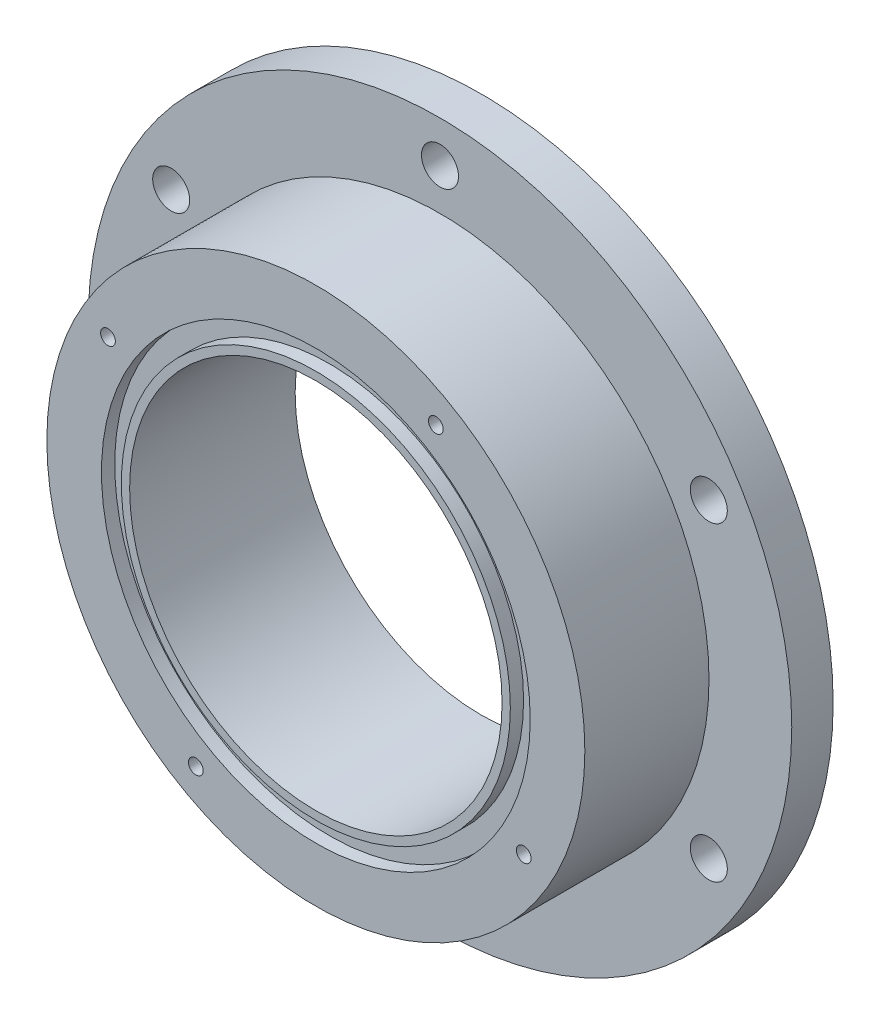
ISO-10303-21;
HEADER;
FILE_DESCRIPTION(('STEP AP214'),'2;1');
FILE_NAME('part.step','',(''),(''),'','','');
FILE_SCHEMA(('AUTOMOTIVE_DESIGN { 1 0 10303 214 1 1 1 1 }'));
ENDSEC;
DATA;
#1=APPLICATION_CONTEXT('core data for automotive mechanical design processes');
#2=APPLICATION_PROTOCOL_DEFINITION('international standard','automotive_design',2000,#1);
#3=PRODUCT_CONTEXT('',#1,'mechanical');
#4=PRODUCT('Part','Part','',(#3));
#5=PRODUCT_RELATED_PRODUCT_CATEGORY('part','',(#4));
#6=PRODUCT_DEFINITION_FORMATION('','',#4);
#7=PRODUCT_DEFINITION_CONTEXT('part definition',#1,'design');
#8=PRODUCT_DEFINITION('design','',#6,#7);
#9=PRODUCT_DEFINITION_SHAPE('','',#8);
#10=(LENGTH_UNIT() NAMED_UNIT(*) SI_UNIT(.MILLI.,.METRE.));
#11=(NAMED_UNIT(*) PLANE_ANGLE_UNIT() SI_UNIT($,.RADIAN.));
#12=(NAMED_UNIT(*) SI_UNIT($,.STERADIAN.) SOLID_ANGLE_UNIT());
#13=UNCERTAINTY_MEASURE_WITH_UNIT(LENGTH_MEASURE(1.E-05),#10,'distance_accuracy_value','');
#14=(GEOMETRIC_REPRESENTATION_CONTEXT(3) GLOBAL_UNCERTAINTY_ASSIGNED_CONTEXT((#13)) GLOBAL_UNIT_ASSIGNED_CONTEXT((#10,
#11,#12)) REPRESENTATION_CONTEXT('',''));
#15=CARTESIAN_POINT('',(0.,0.,0.));
#16=DIRECTION('',(0.,0.,1.));
#17=DIRECTION('',(1.,0.,0.));
#18=AXIS2_PLACEMENT_3D('',#15,#16,#17);
#19=CARTESIAN_POINT('',(0.,0.,25.4));
#20=DIRECTION('',(0.,0.,1.));
#21=DIRECTION('',(1.,0.,0.));
#22=AXIS2_PLACEMENT_3D('',#19,#20,#21);
#23=PLANE('',#22);
#24=CARTESIAN_POINT('',(0.,0.,25.4));
#25=DIRECTION('',(0.,0.,1.));
#26=DIRECTION('',(1.,0.,0.));
#27=AXIS2_PLACEMENT_3D('',#24,#25,#26);
#28=CIRCLE('',#27,28.575);
#29=CARTESIAN_POINT('',(28.575,0.,25.4));
#30=VERTEX_POINT('',#29);
#31=EDGE_CURVE('E106',#30,#30,#28,.T.);
#32=ORIENTED_EDGE('',*,*,#31,.F.);
#33=EDGE_LOOP('',(#32));
#34=FACE_BOUND('',#33,.T.);
#35=CARTESIAN_POINT('',(0.,0.,25.4));
#36=DIRECTION('',(0.,0.,1.));
#37=DIRECTION('',(1.,0.,0.));
#38=AXIS2_PLACEMENT_3D('',#35,#36,#37);
#39=CIRCLE('',#38,29.845);
#40=CARTESIAN_POINT('',(29.845,0.,25.4));
#41=VERTEX_POINT('',#40);
#42=EDGE_CURVE('E96',#41,#41,#39,.T.);
#43=ORIENTED_EDGE('',*,*,#42,.T.);
#44=EDGE_LOOP('',(#43));
#45=FACE_BOUND('',#44,.T.);
#46=ADVANCED_FACE('F38',(#34,#45),#23,.T.);
#47=CARTESIAN_POINT('',(0.,0.,25.4));
#48=DIRECTION('',(0.,0.,-1.));
#49=DIRECTION('',(-1.,0.,0.));
#50=AXIS2_PLACEMENT_3D('',#47,#48,#49);
#51=CYLINDRICAL_SURFACE('',#50,53.975);
#52=CARTESIAN_POINT('',(0.,0.,0.));
#53=DIRECTION('',(0.,0.,1.));
#54=DIRECTION('',(1.,0.,0.));
#55=AXIS2_PLACEMENT_3D('',#52,#53,#54);
#56=CIRCLE('',#55,53.975);
#57=CARTESIAN_POINT('',(53.975,0.,0.));
#58=VERTEX_POINT('',#57);
#59=EDGE_CURVE('E13',#58,#58,#56,.T.);
#60=ORIENTED_EDGE('',*,*,#59,.T.);
#61=EDGE_LOOP('',(#60));
#62=FACE_BOUND('',#61,.T.);
#63=CARTESIAN_POINT('',(0.,0.,6.35));
#64=DIRECTION('',(0.,0.,1.));
#65=DIRECTION('',(1.,0.,0.));
#66=AXIS2_PLACEMENT_3D('',#63,#64,#65);
#67=CIRCLE('',#66,53.975);
#68=CARTESIAN_POINT('',(53.975,0.,6.35));
#69=VERTEX_POINT('',#68);
#70=EDGE_CURVE('E47',#69,#69,#67,.T.);
#71=ORIENTED_EDGE('',*,*,#70,.F.);
#72=EDGE_LOOP('',(#71));
#73=FACE_BOUND('',#72,.T.);
#74=ADVANCED_FACE('F40',(#62,#73),#51,.T.);
#75=CARTESIAN_POINT('',(0.,0.,0.));
#76=DIRECTION('',(0.,0.,1.));
#77=DIRECTION('',(1.,0.,0.));
#78=AXIS2_PLACEMENT_3D('',#75,#76,#77);
#79=PLANE('',#78);
#80=CARTESIAN_POINT('',(41.2444598552336,23.8125000000005,0.));
#81=DIRECTION('',(0.,0.,-1.));
#82=DIRECTION('',(-0.50000000000001,0.866025403784433,0.));
#83=AXIS2_PLACEMENT_3D('',#80,#81,#82);
#84=CIRCLE('',#83,2.8406204239451);
#85=CARTESIAN_POINT('',(39.824149643261,26.2725494496458,0.));
#86=VERTEX_POINT('',#85);
#87=EDGE_CURVE('E148',#86,#86,#84,.T.);
#88=ORIENTED_EDGE('',*,*,#87,.F.);
#89=EDGE_LOOP('',(#88));
#90=FACE_BOUND('',#89,.T.);
#91=CARTESIAN_POINT('',(41.2444598552341,-23.8124999999996,0.));
#92=DIRECTION('',(0.,0.,-1.));
#93=DIRECTION('',(0.499999999999992,0.866025403784443,0.));
#94=AXIS2_PLACEMENT_3D('',#91,#92,#93);
#95=CIRCLE('',#94,2.8406204239451);
#96=CARTESIAN_POINT('',(42.6647700672066,-21.3524505503542,0.));
#97=VERTEX_POINT('',#96);
#98=EDGE_CURVE('E151',#97,#97,#95,.T.);
#99=ORIENTED_EDGE('',*,*,#98,.F.);
#100=EDGE_LOOP('',(#99));
#101=FACE_BOUND('',#100,.T.);
#102=CARTESIAN_POINT('',(0.,-47.625,0.));
#103=DIRECTION('',(0.,0.,-1.));
#104=DIRECTION('',(1.,0.,0.));
#105=AXIS2_PLACEMENT_3D('',#102,#103,#104);
#106=CIRCLE('',#105,2.8406204239451);
#107=CARTESIAN_POINT('',(2.8406204239451,-47.625,0.));
#108=VERTEX_POINT('',#107);
#109=EDGE_CURVE('E154',#108,#108,#106,.T.);
#110=ORIENTED_EDGE('',*,*,#109,.F.);
#111=EDGE_LOOP('',(#110));
#112=FACE_BOUND('',#111,.T.);
#113=CARTESIAN_POINT('',(-41.2444598552338,-23.8125000000002,0.));
#114=DIRECTION('',(0.,0.,-1.));
#115=DIRECTION('',(0.500000000000004,-0.866025403784436,0.));
#116=AXIS2_PLACEMENT_3D('',#113,#114,#115);
#117=CIRCLE('',#116,2.8406204239451);
#118=CARTESIAN_POINT('',(-39.8241496432612,-26.2725494496456,0.));
#119=VERTEX_POINT('',#118);
#120=EDGE_CURVE('E147',#119,#119,#117,.T.);
#121=ORIENTED_EDGE('',*,*,#120,.F.);
#122=EDGE_LOOP('',(#121));
#123=FACE_BOUND('',#122,.T.);
#124=CARTESIAN_POINT('',(-41.2444598552339,23.8124999999999,0.));
#125=DIRECTION('',(0.,0.,-1.));
#126=DIRECTION('',(-0.499999999999998,-0.86602540378444,0.));
#127=AXIS2_PLACEMENT_3D('',#124,#125,#126);
#128=CIRCLE('',#127,2.8406204239451);
#129=CARTESIAN_POINT('',(-42.6647700672065,21.3524505503545,0.));
#130=VERTEX_POINT('',#129);
#131=EDGE_CURVE('E129',#130,#130,#128,.T.);
#132=ORIENTED_EDGE('',*,*,#131,.F.);
#133=EDGE_LOOP('',(#132));
#134=FACE_BOUND('',#133,.T.);
#135=CARTESIAN_POINT('',(0.,47.625,0.));
#136=DIRECTION('',(0.,0.,-1.));
#137=DIRECTION('',(-1.,0.,0.));
#138=AXIS2_PLACEMENT_3D('',#135,#136,#137);
#139=CIRCLE('',#138,2.8406204239451);
#140=CARTESIAN_POINT('',(-2.8406204239451,47.625,0.));
#141=VERTEX_POINT('',#140);
#142=EDGE_CURVE('E124',#141,#141,#139,.T.);
#143=ORIENTED_EDGE('',*,*,#142,.F.);
#144=EDGE_LOOP('',(#143));
#145=FACE_BOUND('',#144,.T.);
#146=CARTESIAN_POINT('',(0.,0.,0.));
#147=DIRECTION('',(0.,0.,1.));
#148=DIRECTION('',(1.,0.,0.));
#149=AXIS2_PLACEMENT_3D('',#146,#147,#148);
#150=CIRCLE('',#149,28.575);
#151=CARTESIAN_POINT('',(28.575,0.,0.));
#152=VERTEX_POINT('',#151);
#153=EDGE_CURVE('E109',#152,#152,#150,.T.);
#154=ORIENTED_EDGE('',*,*,#153,.T.);
#155=EDGE_LOOP('',(#154));
#156=FACE_BOUND('',#155,.T.);
#157=ORIENTED_EDGE('',*,*,#59,.F.);
#158=EDGE_LOOP('',(#157));
#159=FACE_BOUND('',#158,.T.);
#160=ADVANCED_FACE('F162',(#90,#101,#112,#123,#134,#145,#156,#159),#79,.F.);
#161=CARTESIAN_POINT('',(0.,0.,6.35));
#162=DIRECTION('',(0.,0.,1.));
#163=DIRECTION('',(1.,0.,0.));
#164=AXIS2_PLACEMENT_3D('',#161,#162,#163);
#165=PLANE('',#164);
#166=CARTESIAN_POINT('',(41.2444598552336,23.8125000000005,6.35));
#167=DIRECTION('',(0.,0.,1.));
#168=DIRECTION('',(1.,0.,0.));
#169=AXIS2_PLACEMENT_3D('',#166,#167,#168);
#170=CIRCLE('',#169,2.8406204239451);
#171=CARTESIAN_POINT('',(44.0850802791787,23.8125000000005,6.35));
#172=VERTEX_POINT('',#171);
#173=EDGE_CURVE('E42',#172,#172,#170,.T.);
#174=ORIENTED_EDGE('',*,*,#173,.F.);
#175=EDGE_LOOP('',(#174));
#176=FACE_BOUND('',#175,.T.);
#177=CARTESIAN_POINT('',(41.2444598552341,-23.8124999999996,6.35));
#178=DIRECTION('',(0.,0.,1.));
#179=DIRECTION('',(1.,0.,0.));
#180=AXIS2_PLACEMENT_3D('',#177,#178,#179);
#181=CIRCLE('',#180,2.8406204239451);
#182=CARTESIAN_POINT('',(44.0850802791792,-23.8124999999996,6.35));
#183=VERTEX_POINT('',#182);
#184=EDGE_CURVE('E134',#183,#183,#181,.T.);
#185=ORIENTED_EDGE('',*,*,#184,.F.);
#186=EDGE_LOOP('',(#185));
#187=FACE_BOUND('',#186,.T.);
#188=CARTESIAN_POINT('',(0.,-47.625,6.35));
#189=DIRECTION('',(0.,0.,1.));
#190=DIRECTION('',(1.,0.,0.));
#191=AXIS2_PLACEMENT_3D('',#188,#189,#190);
#192=CIRCLE('',#191,2.8406204239451);
#193=CARTESIAN_POINT('',(2.8406204239451,-47.625,6.35));
#194=VERTEX_POINT('',#193);
#195=EDGE_CURVE('E132',#194,#194,#192,.T.);
#196=ORIENTED_EDGE('',*,*,#195,.F.);
#197=EDGE_LOOP('',(#196));
#198=FACE_BOUND('',#197,.T.);
#199=CARTESIAN_POINT('',(-41.2444598552338,-23.8125000000002,6.35));
#200=DIRECTION('',(0.,0.,1.));
#201=DIRECTION('',(1.,0.,0.));
#202=AXIS2_PLACEMENT_3D('',#199,#200,#201);
#203=CIRCLE('',#202,2.8406204239451);
#204=CARTESIAN_POINT('',(-38.4038394312887,-23.8125000000002,6.35));
#205=VERTEX_POINT('',#204);
#206=EDGE_CURVE('E128',#205,#205,#203,.T.);
#207=ORIENTED_EDGE('',*,*,#206,.F.);
#208=EDGE_LOOP('',(#207));
#209=FACE_BOUND('',#208,.T.);
#210=CARTESIAN_POINT('',(-41.2444598552339,23.8124999999999,6.35));
#211=DIRECTION('',(0.,0.,1.));
#212=DIRECTION('',(1.,0.,0.));
#213=AXIS2_PLACEMENT_3D('',#210,#211,#212);
#214=CIRCLE('',#213,2.8406204239451);
#215=CARTESIAN_POINT('',(-38.4038394312889,23.8124999999999,6.35));
#216=VERTEX_POINT('',#215);
#217=EDGE_CURVE('E125',#216,#216,#214,.T.);
#218=ORIENTED_EDGE('',*,*,#217,.F.);
#219=EDGE_LOOP('',(#218));
#220=FACE_BOUND('',#219,.T.);
#221=CARTESIAN_POINT('',(0.,47.625,6.35));
#222=DIRECTION('',(0.,0.,1.));
#223=DIRECTION('',(1.,0.,0.));
#224=AXIS2_PLACEMENT_3D('',#221,#222,#223);
#225=CIRCLE('',#224,2.8406204239451);
#226=CARTESIAN_POINT('',(2.8406204239451,47.625,6.35));
#227=VERTEX_POINT('',#226);
#228=EDGE_CURVE('E78',#227,#227,#225,.T.);
#229=ORIENTED_EDGE('',*,*,#228,.F.);
#230=EDGE_LOOP('',(#229));
#231=FACE_BOUND('',#230,.T.);
#232=CARTESIAN_POINT('',(0.,0.,6.34999999999999));
#233=DIRECTION('',(0.,0.,1.));
#234=DIRECTION('',(1.,0.,0.));
#235=AXIS2_PLACEMENT_3D('',#232,#233,#234);
#236=CIRCLE('',#235,41.275);
#237=CARTESIAN_POINT('',(41.275,0.,6.34999999999999));
#238=VERTEX_POINT('',#237);
#239=EDGE_CURVE('E117',#238,#238,#236,.F.);
#240=ORIENTED_EDGE('',*,*,#239,.T.);
#241=EDGE_LOOP('',(#240));
#242=FACE_BOUND('',#241,.T.);
#243=ORIENTED_EDGE('',*,*,#70,.T.);
#244=EDGE_LOOP('',(#243));
#245=FACE_BOUND('',#244,.T.);
#246=ADVANCED_FACE('F165',(#176,#187,#198,#209,#220,#231,#242,#245),#165,.T.);
#247=CARTESIAN_POINT('',(0.,0.,-154.190997598757));
#248=DIRECTION('',(0.,0.,1.));
#249=DIRECTION('',(1.,0.,0.));
#250=AXIS2_PLACEMENT_3D('',#247,#248,#249);
#251=CYLINDRICAL_SURFACE('',#250,41.275);
#252=ORIENTED_EDGE('',*,*,#239,.F.);
#253=EDGE_LOOP('',(#252));
#254=FACE_BOUND('',#253,.T.);
#255=CARTESIAN_POINT('',(0.,0.,25.4));
#256=DIRECTION('',(0.,0.,1.));
#257=DIRECTION('',(1.,0.,0.));
#258=AXIS2_PLACEMENT_3D('',#255,#256,#257);
#259=CIRCLE('',#258,41.275);
#260=CARTESIAN_POINT('',(41.275,0.,25.4));
#261=VERTEX_POINT('',#260);
#262=EDGE_CURVE('E112',#261,#261,#259,.T.);
#263=ORIENTED_EDGE('',*,*,#262,.F.);
#264=EDGE_LOOP('',(#263));
#265=FACE_BOUND('',#264,.T.);
#266=ADVANCED_FACE('F179',(#254,#265),#251,.T.);
#267=CARTESIAN_POINT('',(31.895715621381,-18.4149999999997,25.4));
#268=DIRECTION('',(0.,0.,1.));
#269=DIRECTION('',(1.,0.,0.));
#270=AXIS2_PLACEMENT_3D('',#267,#268,#269);
#271=CIRCLE('',#270,1.1303);
#272=CARTESIAN_POINT('',(33.026015621381,-18.4149999999997,25.4));
#273=VERTEX_POINT('',#272);
#274=EDGE_CURVE('E72',#273,#273,#271,.T.);
#275=ORIENTED_EDGE('',*,*,#274,.F.);
#276=EDGE_LOOP('',(#275));
#277=FACE_BOUND('',#276,.T.);
#278=CARTESIAN_POINT('',(-18.415,-31.8957156213808,25.4));
#279=DIRECTION('',(0.,0.,1.));
#280=DIRECTION('',(1.,0.,0.));
#281=AXIS2_PLACEMENT_3D('',#278,#279,#280);
#282=CIRCLE('',#281,1.1303);
#283=CARTESIAN_POINT('',(-17.2847,-31.8957156213808,25.4));
#284=VERTEX_POINT('',#283);
#285=EDGE_CURVE('E71',#284,#284,#282,.T.);
#286=ORIENTED_EDGE('',*,*,#285,.F.);
#287=EDGE_LOOP('',(#286));
#288=FACE_BOUND('',#287,.T.);
#289=CARTESIAN_POINT('',(-31.8957156213809,18.4149999999999,25.4));
#290=DIRECTION('',(0.,0.,1.));
#291=DIRECTION('',(1.,0.,0.));
#292=AXIS2_PLACEMENT_3D('',#289,#290,#291);
#293=CIRCLE('',#292,1.1303);
#294=CARTESIAN_POINT('',(-30.7654156213809,18.4149999999999,25.4));
#295=VERTEX_POINT('',#294);
#296=EDGE_CURVE('E84',#295,#295,#293,.T.);
#297=ORIENTED_EDGE('',*,*,#296,.F.);
#298=EDGE_LOOP('',(#297));
#299=FACE_BOUND('',#298,.T.);
#300=CARTESIAN_POINT('',(18.415,31.8957156213808,25.4));
#301=DIRECTION('',(0.,0.,1.));
#302=DIRECTION('',(1.,0.,0.));
#303=AXIS2_PLACEMENT_3D('',#300,#301,#302);
#304=CIRCLE('',#303,1.1303);
#305=CARTESIAN_POINT('',(19.5453,31.8957156213808,25.4));
#306=VERTEX_POINT('',#305);
#307=EDGE_CURVE('E90',#306,#306,#304,.T.);
#308=ORIENTED_EDGE('',*,*,#307,.F.);
#309=EDGE_LOOP('',(#308));
#310=FACE_BOUND('',#309,.T.);
#311=CARTESIAN_POINT('',(0.,0.,25.4));
#312=DIRECTION('',(0.,0.,1.));
#313=DIRECTION('',(1.,0.,0.));
#314=AXIS2_PLACEMENT_3D('',#311,#312,#313);
#315=CIRCLE('',#314,32.893);
#316=CARTESIAN_POINT('',(32.893,0.,25.4));
#317=VERTEX_POINT('',#316);
#318=EDGE_CURVE('E100',#317,#317,#315,.T.);
#319=ORIENTED_EDGE('',*,*,#318,.F.);
#320=EDGE_LOOP('',(#319));
#321=FACE_BOUND('',#320,.T.);
#322=ORIENTED_EDGE('',*,*,#262,.T.);
#323=EDGE_LOOP('',(#322));
#324=FACE_BOUND('',#323,.T.);
#325=ADVANCED_FACE('F185',(#277,#288,#299,#310,#321,#324),#23,.T.);
#326=CARTESIAN_POINT('',(0.,0.,0.));
#327=DIRECTION('',(0.,0.,1.));
#328=DIRECTION('',(1.,0.,0.));
#329=AXIS2_PLACEMENT_3D('',#326,#327,#328);
#330=CYLINDRICAL_SURFACE('',#329,28.575);
#331=ORIENTED_EDGE('',*,*,#153,.F.);
#332=EDGE_LOOP('',(#331));
#333=FACE_BOUND('',#332,.T.);
#334=ORIENTED_EDGE('',*,*,#31,.T.);
#335=EDGE_LOOP('',(#334));
#336=FACE_BOUND('',#335,.T.);
#337=ADVANCED_FACE('F198',(#333,#336),#330,.F.);
#338=CARTESIAN_POINT('',(0.,0.,23.368));
#339=DIRECTION('',(0.,0.,1.));
#340=DIRECTION('',(1.,0.,0.));
#341=AXIS2_PLACEMENT_3D('',#338,#339,#340);
#342=CYLINDRICAL_SURFACE('',#341,32.893);
#343=CARTESIAN_POINT('',(0.,0.,23.368));
#344=DIRECTION('',(0.,0.,1.));
#345=DIRECTION('',(1.,0.,0.));
#346=AXIS2_PLACEMENT_3D('',#343,#344,#345);
#347=CIRCLE('',#346,32.893);
#348=CARTESIAN_POINT('',(32.893,0.,23.368));
#349=VERTEX_POINT('',#348);
#350=EDGE_CURVE('E103',#349,#349,#347,.T.);
#351=ORIENTED_EDGE('',*,*,#350,.F.);
#352=EDGE_LOOP('',(#351));
#353=FACE_BOUND('',#352,.T.);
#354=ORIENTED_EDGE('',*,*,#318,.T.);
#355=EDGE_LOOP('',(#354));
#356=FACE_BOUND('',#355,.T.);
#357=ADVANCED_FACE('F203',(#353,#356),#342,.F.);
#358=CARTESIAN_POINT('',(0.,0.,23.368));
#359=DIRECTION('',(0.,0.,1.));
#360=DIRECTION('',(1.,0.,0.));
#361=AXIS2_PLACEMENT_3D('',#358,#359,#360);
#362=PLANE('',#361);
#363=CARTESIAN_POINT('',(0.,0.,23.368));
#364=DIRECTION('',(0.,0.,1.));
#365=DIRECTION('',(1.,0.,0.));
#366=AXIS2_PLACEMENT_3D('',#363,#364,#365);
#367=CIRCLE('',#366,29.845);
#368=CARTESIAN_POINT('',(29.845,0.,23.368));
#369=VERTEX_POINT('',#368);
#370=EDGE_CURVE('E97',#369,#369,#367,.T.);
#371=ORIENTED_EDGE('',*,*,#370,.F.);
#372=EDGE_LOOP('',(#371));
#373=FACE_BOUND('',#372,.T.);
#374=ORIENTED_EDGE('',*,*,#350,.T.);
#375=EDGE_LOOP('',(#374));
#376=FACE_BOUND('',#375,.T.);
#377=ADVANCED_FACE('F219',(#373,#376),#362,.T.);
#378=CARTESIAN_POINT('',(0.,0.,23.368));
#379=DIRECTION('',(0.,0.,1.));
#380=DIRECTION('',(1.,0.,0.));
#381=AXIS2_PLACEMENT_3D('',#378,#379,#380);
#382=CYLINDRICAL_SURFACE('',#381,29.845);
#383=ORIENTED_EDGE('',*,*,#370,.T.);
#384=EDGE_LOOP('',(#383));
#385=FACE_BOUND('',#384,.T.);
#386=ORIENTED_EDGE('',*,*,#42,.F.);
#387=EDGE_LOOP('',(#386));
#388=FACE_BOUND('',#387,.T.);
#389=ADVANCED_FACE('F225',(#385,#388),#382,.T.);
#390=CARTESIAN_POINT('',(18.415,31.8957156213808,15.113));
#391=DIRECTION('',(0.,0.,1.));
#392=DIRECTION('',(1.,0.,0.));
#393=AXIS2_PLACEMENT_3D('',#390,#391,#392);
#394=CONICAL_SURFACE('',#393,1.1303,1.02974425867665);
#395=CARTESIAN_POINT('',(18.415,31.8957156213808,14.4338472423131));
#396=VERTEX_POINT('',#395);
#397=VERTEX_LOOP('',#396);
#398=FACE_BOUND('',#397,.T.);
#399=CARTESIAN_POINT('',(18.415,31.8957156213808,15.113));
#400=DIRECTION('',(0.,0.,1.));
#401=DIRECTION('',(1.,0.,0.));
#402=AXIS2_PLACEMENT_3D('',#399,#400,#401);
#403=CIRCLE('',#402,1.1303);
#404=CARTESIAN_POINT('',(19.5453,31.8957156213808,15.113));
#405=VERTEX_POINT('',#404);
#406=EDGE_CURVE('E93',#405,#405,#403,.T.);
#407=ORIENTED_EDGE('',*,*,#406,.T.);
#408=EDGE_LOOP('',(#407));
#409=FACE_BOUND('',#408,.T.);
#410=ADVANCED_FACE('F232',(#398,#409),#394,.F.);
#411=CARTESIAN_POINT('',(18.415,31.8957156213808,25.4));
#412=DIRECTION('',(0.,0.,1.));
#413=DIRECTION('',(1.,0.,0.));
#414=AXIS2_PLACEMENT_3D('',#411,#412,#413);
#415=CYLINDRICAL_SURFACE('',#414,1.1303);
#416=ORIENTED_EDGE('',*,*,#406,.F.);
#417=EDGE_LOOP('',(#416));
#418=FACE_BOUND('',#417,.T.);
#419=ORIENTED_EDGE('',*,*,#307,.T.);
#420=EDGE_LOOP('',(#419));
#421=FACE_BOUND('',#420,.T.);
#422=ADVANCED_FACE('F236',(#418,#421),#415,.F.);
#423=CARTESIAN_POINT('',(-31.8957156213809,18.4149999999999,15.113));
#424=DIRECTION('',(0.,0.,1.));
#425=DIRECTION('',(1.,0.,0.));
#426=AXIS2_PLACEMENT_3D('',#423,#424,#425);
#427=CONICAL_SURFACE('',#426,1.1303,1.02974425867665);
#428=CARTESIAN_POINT('',(-31.8957156213809,18.4149999999999,14.4338472423131));
#429=VERTEX_POINT('',#428);
#430=VERTEX_LOOP('',#429);
#431=FACE_BOUND('',#430,.T.);
#432=CARTESIAN_POINT('',(-31.8957156213809,18.4149999999999,15.113));
#433=DIRECTION('',(0.,0.,1.));
#434=DIRECTION('',(1.,0.,0.));
#435=AXIS2_PLACEMENT_3D('',#432,#433,#434);
#436=CIRCLE('',#435,1.1303);
#437=CARTESIAN_POINT('',(-30.7654156213809,18.4149999999999,15.113));
#438=VERTEX_POINT('',#437);
#439=EDGE_CURVE('E87',#438,#438,#436,.T.);
#440=ORIENTED_EDGE('',*,*,#439,.T.);
#441=EDGE_LOOP('',(#440));
#442=FACE_BOUND('',#441,.T.);
#443=ADVANCED_FACE('F239',(#431,#442),#427,.F.);
#444=CARTESIAN_POINT('',(-31.8957156213809,18.4149999999999,25.4));
#445=DIRECTION('',(0.,0.,1.));
#446=DIRECTION('',(1.,0.,0.));
#447=AXIS2_PLACEMENT_3D('',#444,#445,#446);
#448=CYLINDRICAL_SURFACE('',#447,1.1303);
#449=ORIENTED_EDGE('',*,*,#439,.F.);
#450=EDGE_LOOP('',(#449));
#451=FACE_BOUND('',#450,.T.);
#452=ORIENTED_EDGE('',*,*,#296,.T.);
#453=EDGE_LOOP('',(#452));
#454=FACE_BOUND('',#453,.T.);
#455=ADVANCED_FACE('F243',(#451,#454),#448,.F.);
#456=CARTESIAN_POINT('',(-18.415,-31.8957156213808,15.113));
#457=DIRECTION('',(0.,0.,1.));
#458=DIRECTION('',(1.,0.,0.));
#459=AXIS2_PLACEMENT_3D('',#456,#457,#458);
#460=CONICAL_SURFACE('',#459,1.1303,1.02974425867665);
#461=CARTESIAN_POINT('',(-18.415,-31.8957156213808,14.4338472423131));
#462=VERTEX_POINT('',#461);
#463=VERTEX_LOOP('',#462);
#464=FACE_BOUND('',#463,.T.);
#465=CARTESIAN_POINT('',(-18.415,-31.8957156213808,15.113));
#466=DIRECTION('',(0.,0.,1.));
#467=DIRECTION('',(1.,0.,0.));
#468=AXIS2_PLACEMENT_3D('',#465,#466,#467);
#469=CIRCLE('',#468,1.1303);
#470=CARTESIAN_POINT('',(-17.2847,-31.8957156213808,15.113));
#471=VERTEX_POINT('',#470);
#472=EDGE_CURVE('E75',#471,#471,#469,.T.);
#473=ORIENTED_EDGE('',*,*,#472,.T.);
#474=EDGE_LOOP('',(#473));
#475=FACE_BOUND('',#474,.T.);
#476=ADVANCED_FACE('F246',(#464,#475),#460,.F.);
#477=CARTESIAN_POINT('',(-18.415,-31.8957156213808,25.4));
#478=DIRECTION('',(0.,0.,1.));
#479=DIRECTION('',(1.,0.,0.));
#480=AXIS2_PLACEMENT_3D('',#477,#478,#479);
#481=CYLINDRICAL_SURFACE('',#480,1.1303);
#482=ORIENTED_EDGE('',*,*,#472,.F.);
#483=EDGE_LOOP('',(#482));
#484=FACE_BOUND('',#483,.T.);
#485=ORIENTED_EDGE('',*,*,#285,.T.);
#486=EDGE_LOOP('',(#485));
#487=FACE_BOUND('',#486,.T.);
#488=ADVANCED_FACE('F65',(#484,#487),#481,.F.);
#489=CARTESIAN_POINT('',(31.895715621381,-18.4149999999997,15.113));
#490=DIRECTION('',(0.,0.,1.));
#491=DIRECTION('',(1.,0.,0.));
#492=AXIS2_PLACEMENT_3D('',#489,#490,#491);
#493=CONICAL_SURFACE('',#492,1.13029999999999,1.02974425867665);
#494=CARTESIAN_POINT('',(31.895715621381,-18.4149999999997,14.4338472423131));
#495=VERTEX_POINT('',#494);
#496=VERTEX_LOOP('',#495);
#497=FACE_BOUND('',#496,.T.);
#498=CARTESIAN_POINT('',(31.895715621381,-18.4149999999997,15.113));
#499=DIRECTION('',(0.,0.,1.));
#500=DIRECTION('',(1.,0.,0.));
#501=AXIS2_PLACEMENT_3D('',#498,#499,#500);
#502=CIRCLE('',#501,1.13029999999999);
#503=CARTESIAN_POINT('',(33.026015621381,-18.4149999999997,15.113));
#504=VERTEX_POINT('',#503);
#505=EDGE_CURVE('E69',#504,#504,#502,.T.);
#506=ORIENTED_EDGE('',*,*,#505,.T.);
#507=EDGE_LOOP('',(#506));
#508=FACE_BOUND('',#507,.T.);
#509=ADVANCED_FACE('F61',(#497,#508),#493,.F.);
#510=CARTESIAN_POINT('',(31.895715621381,-18.4149999999997,25.4));
#511=DIRECTION('',(0.,0.,1.));
#512=DIRECTION('',(1.,0.,0.));
#513=AXIS2_PLACEMENT_3D('',#510,#511,#512);
#514=CYLINDRICAL_SURFACE('',#513,1.1303);
#515=ORIENTED_EDGE('',*,*,#505,.F.);
#516=EDGE_LOOP('',(#515));
#517=FACE_BOUND('',#516,.T.);
#518=ORIENTED_EDGE('',*,*,#274,.T.);
#519=EDGE_LOOP('',(#518));
#520=FACE_BOUND('',#519,.T.);
#521=ADVANCED_FACE('F64',(#517,#520),#514,.F.);
#522=CARTESIAN_POINT('',(0.,47.625,25.4));
#523=DIRECTION('',(0.,0.,-1.));
#524=DIRECTION('',(-1.,0.,0.));
#525=AXIS2_PLACEMENT_3D('',#522,#523,#524);
#526=CYLINDRICAL_SURFACE('',#525,2.8406204239451);
#527=ORIENTED_EDGE('',*,*,#228,.T.);
#528=EDGE_LOOP('',(#527));
#529=FACE_BOUND('',#528,.T.);
#530=ORIENTED_EDGE('',*,*,#142,.T.);
#531=EDGE_LOOP('',(#530));
#532=FACE_BOUND('',#531,.T.);
#533=ADVANCED_FACE('F256',(#529,#532),#526,.F.);
#534=CARTESIAN_POINT('',(-41.2444598552339,23.8124999999999,25.4));
#535=DIRECTION('',(0.,0.,-1.));
#536=DIRECTION('',(-1.,0.,0.));
#537=AXIS2_PLACEMENT_3D('',#534,#535,#536);
#538=CYLINDRICAL_SURFACE('',#537,2.8406204239451);
#539=ORIENTED_EDGE('',*,*,#217,.T.);
#540=EDGE_LOOP('',(#539));
#541=FACE_BOUND('',#540,.T.);
#542=ORIENTED_EDGE('',*,*,#131,.T.);
#543=EDGE_LOOP('',(#542));
#544=FACE_BOUND('',#543,.T.);
#545=ADVANCED_FACE('F259',(#541,#544),#538,.F.);
#546=CARTESIAN_POINT('',(-41.2444598552338,-23.8125000000002,25.4));
#547=DIRECTION('',(0.,0.,-1.));
#548=DIRECTION('',(-1.,0.,0.));
#549=AXIS2_PLACEMENT_3D('',#546,#547,#548);
#550=CYLINDRICAL_SURFACE('',#549,2.8406204239451);
#551=ORIENTED_EDGE('',*,*,#206,.T.);
#552=EDGE_LOOP('',(#551));
#553=FACE_BOUND('',#552,.T.);
#554=ORIENTED_EDGE('',*,*,#120,.T.);
#555=EDGE_LOOP('',(#554));
#556=FACE_BOUND('',#555,.T.);
#557=ADVANCED_FACE('F160',(#553,#556),#550,.F.);
#558=CARTESIAN_POINT('',(0.,-47.625,25.4));
#559=DIRECTION('',(0.,0.,-1.));
#560=DIRECTION('',(-1.,0.,0.));
#561=AXIS2_PLACEMENT_3D('',#558,#559,#560);
#562=CYLINDRICAL_SURFACE('',#561,2.8406204239451);
#563=ORIENTED_EDGE('',*,*,#195,.T.);
#564=EDGE_LOOP('',(#563));
#565=FACE_BOUND('',#564,.T.);
#566=ORIENTED_EDGE('',*,*,#109,.T.);
#567=EDGE_LOOP('',(#566));
#568=FACE_BOUND('',#567,.T.);
#569=ADVANCED_FACE('F270',(#565,#568),#562,.F.);
#570=CARTESIAN_POINT('',(41.2444598552341,-23.8124999999996,25.4));
#571=DIRECTION('',(0.,0.,-1.));
#572=DIRECTION('',(-1.,0.,0.));
#573=AXIS2_PLACEMENT_3D('',#570,#571,#572);
#574=CYLINDRICAL_SURFACE('',#573,2.8406204239451);
#575=ORIENTED_EDGE('',*,*,#184,.T.);
#576=EDGE_LOOP('',(#575));
#577=FACE_BOUND('',#576,.T.);
#578=ORIENTED_EDGE('',*,*,#98,.T.);
#579=EDGE_LOOP('',(#578));
#580=FACE_BOUND('',#579,.T.);
#581=ADVANCED_FACE('F267',(#577,#580),#574,.F.);
#582=CARTESIAN_POINT('',(41.2444598552336,23.8125000000005,25.4));
#583=DIRECTION('',(0.,0.,-1.));
#584=DIRECTION('',(-1.,0.,0.));
#585=AXIS2_PLACEMENT_3D('',#582,#583,#584);
#586=CYLINDRICAL_SURFACE('',#585,2.8406204239451);
#587=ORIENTED_EDGE('',*,*,#173,.T.);
#588=EDGE_LOOP('',(#587));
#589=FACE_BOUND('',#588,.T.);
#590=ORIENTED_EDGE('',*,*,#87,.T.);
#591=EDGE_LOOP('',(#590));
#592=FACE_BOUND('',#591,.T.);
#593=ADVANCED_FACE('F264',(#589,#592),#586,.F.);
#594=CLOSED_SHELL('',(#46,#74,#160,#246,#266,#325,#337,#357,#377,#389,#410,#422,#443,#455,#476,
#488,#509,#521,#533,#545,#557,#569,#581,#593));
#595=MANIFOLD_SOLID_BREP('B2',#594);
#596=ADVANCED_BREP_SHAPE_REPRESENTATION('',(#18,#595),#14);
#597=SHAPE_DEFINITION_REPRESENTATION(#9,#596);
ENDSEC;
END-ISO-10303-21;
